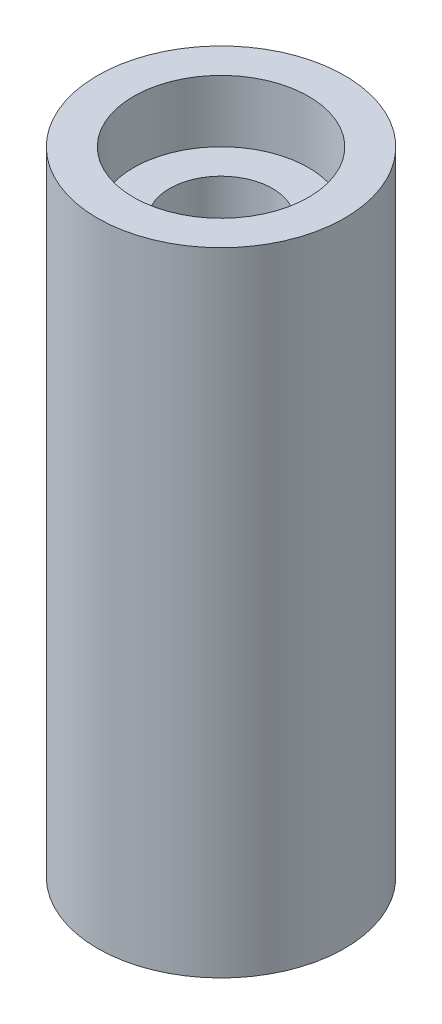
ISO-10303-21;
HEADER;
FILE_DESCRIPTION(('STEP AP214'),'2;1');
FILE_NAME('part.step','',(''),(''),'','','');
FILE_SCHEMA(('AUTOMOTIVE_DESIGN { 1 0 10303 214 1 1 1 1 }'));
ENDSEC;
DATA;
#1=APPLICATION_CONTEXT('core data for automotive mechanical design processes');
#2=APPLICATION_PROTOCOL_DEFINITION('international standard','automotive_design',2000,#1);
#3=PRODUCT_CONTEXT('',#1,'mechanical');
#4=PRODUCT('Part','Part','',(#3));
#5=PRODUCT_RELATED_PRODUCT_CATEGORY('part','',(#4));
#6=PRODUCT_DEFINITION_FORMATION('','',#4);
#7=PRODUCT_DEFINITION_CONTEXT('part definition',#1,'design');
#8=PRODUCT_DEFINITION('design','',#6,#7);
#9=PRODUCT_DEFINITION_SHAPE('','',#8);
#10=(LENGTH_UNIT() NAMED_UNIT(*) SI_UNIT(.MILLI.,.METRE.));
#11=(NAMED_UNIT(*) PLANE_ANGLE_UNIT() SI_UNIT($,.RADIAN.));
#12=(NAMED_UNIT(*) SI_UNIT($,.STERADIAN.) SOLID_ANGLE_UNIT());
#13=UNCERTAINTY_MEASURE_WITH_UNIT(LENGTH_MEASURE(1.E-05),#10,'distance_accuracy_value','');
#14=(GEOMETRIC_REPRESENTATION_CONTEXT(3) GLOBAL_UNCERTAINTY_ASSIGNED_CONTEXT((#13)) GLOBAL_UNIT_ASSIGNED_CONTEXT((#10,
#11,#12)) REPRESENTATION_CONTEXT('',''));
#15=CARTESIAN_POINT('',(0.,0.,0.));
#16=DIRECTION('',(0.,0.,1.));
#17=DIRECTION('',(1.,0.,0.));
#18=AXIS2_PLACEMENT_3D('',#15,#16,#17);
#19=CARTESIAN_POINT('',(0.,-97.5,0.));
#20=DIRECTION('',(0.,1.,0.));
#21=DIRECTION('',(0.,0.,1.));
#22=AXIS2_PLACEMENT_3D('',#19,#20,#21);
#23=CYLINDRICAL_SURFACE('',#22,38.1);
#24=CARTESIAN_POINT('',(0.,-97.5,0.));
#25=DIRECTION('',(0.,1.,0.));
#26=DIRECTION('',(0.,0.,1.));
#27=AXIS2_PLACEMENT_3D('',#24,#25,#26);
#28=CIRCLE('',#27,38.1);
#29=CARTESIAN_POINT('',(0.,-97.5,38.1));
#30=VERTEX_POINT('',#29);
#31=EDGE_CURVE('E10',#30,#30,#28,.T.);
#32=ORIENTED_EDGE('',*,*,#31,.T.);
#33=EDGE_LOOP('',(#32));
#34=FACE_BOUND('',#33,.T.);
#35=CARTESIAN_POINT('',(0.,97.5,0.));
#36=DIRECTION('',(0.,1.,0.));
#37=DIRECTION('',(0.,0.,1.));
#38=AXIS2_PLACEMENT_3D('',#35,#36,#37);
#39=CIRCLE('',#38,38.1);
#40=CARTESIAN_POINT('',(0.,97.5,38.1));
#41=VERTEX_POINT('',#40);
#42=EDGE_CURVE('E48',#41,#41,#39,.T.);
#43=ORIENTED_EDGE('',*,*,#42,.F.);
#44=EDGE_LOOP('',(#43));
#45=FACE_BOUND('',#44,.T.);
#46=ADVANCED_FACE('F40',(#34,#45),#23,.T.);
#47=CARTESIAN_POINT('',(0.,-97.5,0.));
#48=DIRECTION('',(0.,1.,0.));
#49=DIRECTION('',(0.,0.,1.));
#50=AXIS2_PLACEMENT_3D('',#47,#48,#49);
#51=PLANE('',#50);
#52=CARTESIAN_POINT('',(0.,-97.5,0.));
#53=DIRECTION('',(0.,1.,0.));
#54=DIRECTION('',(0.,0.,1.));
#55=AXIS2_PLACEMENT_3D('',#52,#53,#54);
#56=CIRCLE('',#55,26.9875);
#57=CARTESIAN_POINT('',(0.,-97.5,26.9875));
#58=VERTEX_POINT('',#57);
#59=EDGE_CURVE('E64',#58,#58,#56,.T.);
#60=ORIENTED_EDGE('',*,*,#59,.T.);
#61=EDGE_LOOP('',(#60));
#62=FACE_BOUND('',#61,.T.);
#63=ORIENTED_EDGE('',*,*,#31,.F.);
#64=EDGE_LOOP('',(#63));
#65=FACE_BOUND('',#64,.T.);
#66=ADVANCED_FACE('F95',(#62,#65),#51,.F.);
#67=CARTESIAN_POINT('',(0.,97.5,0.));
#68=DIRECTION('',(0.,1.,0.));
#69=DIRECTION('',(0.,0.,1.));
#70=AXIS2_PLACEMENT_3D('',#67,#68,#69);
#71=PLANE('',#70);
#72=CARTESIAN_POINT('',(0.,97.5,0.));
#73=DIRECTION('',(0.,1.,0.));
#74=DIRECTION('',(0.,0.,1.));
#75=AXIS2_PLACEMENT_3D('',#72,#73,#74);
#76=CIRCLE('',#75,26.9875);
#77=CARTESIAN_POINT('',(0.,97.5,26.9875));
#78=VERTEX_POINT('',#77);
#79=EDGE_CURVE('E56',#78,#78,#76,.T.);
#80=ORIENTED_EDGE('',*,*,#79,.F.);
#81=EDGE_LOOP('',(#80));
#82=FACE_BOUND('',#81,.T.);
#83=ORIENTED_EDGE('',*,*,#42,.T.);
#84=EDGE_LOOP('',(#83));
#85=FACE_BOUND('',#84,.T.);
#86=ADVANCED_FACE('F98',(#82,#85),#71,.T.);
#87=CARTESIAN_POINT('',(0.,78.45,0.));
#88=DIRECTION('',(0.,1.,0.));
#89=DIRECTION('',(0.,0.,1.));
#90=AXIS2_PLACEMENT_3D('',#87,#88,#89);
#91=CYLINDRICAL_SURFACE('',#90,26.9875);
#92=CARTESIAN_POINT('',(0.,78.45,0.));
#93=DIRECTION('',(0.,1.,0.));
#94=DIRECTION('',(0.,0.,1.));
#95=AXIS2_PLACEMENT_3D('',#92,#93,#94);
#96=CIRCLE('',#95,26.9875);
#97=CARTESIAN_POINT('',(0.,78.45,26.9875));
#98=VERTEX_POINT('',#97);
#99=EDGE_CURVE('E53',#98,#98,#96,.T.);
#100=ORIENTED_EDGE('',*,*,#99,.F.);
#101=EDGE_LOOP('',(#100));
#102=FACE_BOUND('',#101,.T.);
#103=ORIENTED_EDGE('',*,*,#79,.T.);
#104=EDGE_LOOP('',(#103));
#105=FACE_BOUND('',#104,.T.);
#106=ADVANCED_FACE('F103',(#102,#105),#91,.F.);
#107=CARTESIAN_POINT('',(0.,78.45,0.));
#108=DIRECTION('',(0.,1.,0.));
#109=DIRECTION('',(0.,0.,1.));
#110=AXIS2_PLACEMENT_3D('',#107,#108,#109);
#111=PLANE('',#110);
#112=CARTESIAN_POINT('',(0.,78.45,0.));
#113=DIRECTION('',(0.,1.,0.));
#114=DIRECTION('',(0.,0.,1.));
#115=AXIS2_PLACEMENT_3D('',#112,#113,#114);
#116=CIRCLE('',#115,15.875);
#117=CARTESIAN_POINT('',(0.,78.45,15.875));
#118=VERTEX_POINT('',#117);
#119=EDGE_CURVE('E71',#118,#118,#116,.T.);
#120=ORIENTED_EDGE('',*,*,#119,.F.);
#121=EDGE_LOOP('',(#120));
#122=FACE_BOUND('',#121,.T.);
#123=ORIENTED_EDGE('',*,*,#99,.T.);
#124=EDGE_LOOP('',(#123));
#125=FACE_BOUND('',#124,.T.);
#126=ADVANCED_FACE('F91',(#122,#125),#111,.T.);
#127=CARTESIAN_POINT('',(0.,-78.45,0.));
#128=DIRECTION('',(0.,-1.,0.));
#129=DIRECTION('',(0.,0.,-1.));
#130=AXIS2_PLACEMENT_3D('',#127,#128,#129);
#131=CYLINDRICAL_SURFACE('',#130,26.9875);
#132=CARTESIAN_POINT('',(0.,-78.45,0.));
#133=DIRECTION('',(0.,1.,0.));
#134=DIRECTION('',(0.,0.,1.));
#135=AXIS2_PLACEMENT_3D('',#132,#133,#134);
#136=CIRCLE('',#135,26.9875);
#137=CARTESIAN_POINT('',(0.,-78.45,26.9875));
#138=VERTEX_POINT('',#137);
#139=EDGE_CURVE('E60',#138,#138,#136,.T.);
#140=ORIENTED_EDGE('',*,*,#139,.T.);
#141=EDGE_LOOP('',(#140));
#142=FACE_BOUND('',#141,.T.);
#143=ORIENTED_EDGE('',*,*,#59,.F.);
#144=EDGE_LOOP('',(#143));
#145=FACE_BOUND('',#144,.T.);
#146=ADVANCED_FACE('F85',(#142,#145),#131,.F.);
#147=CARTESIAN_POINT('',(0.,-78.45,0.));
#148=DIRECTION('',(0.,-1.,0.));
#149=DIRECTION('',(0.,0.,1.));
#150=AXIS2_PLACEMENT_3D('',#147,#148,#149);
#151=PLANE('',#150);
#152=CARTESIAN_POINT('',(0.,-78.45,0.));
#153=DIRECTION('',(0.,-1.,0.));
#154=DIRECTION('',(0.,0.,-1.));
#155=AXIS2_PLACEMENT_3D('',#152,#153,#154);
#156=CIRCLE('',#155,15.875);
#157=CARTESIAN_POINT('',(0.,-78.45,-15.875));
#158=VERTEX_POINT('',#157);
#159=EDGE_CURVE('E43',#158,#158,#156,.T.);
#160=ORIENTED_EDGE('',*,*,#159,.F.);
#161=EDGE_LOOP('',(#160));
#162=FACE_BOUND('',#161,.T.);
#163=ORIENTED_EDGE('',*,*,#139,.F.);
#164=EDGE_LOOP('',(#163));
#165=FACE_BOUND('',#164,.T.);
#166=ADVANCED_FACE('F82',(#162,#165),#151,.T.);
#167=CARTESIAN_POINT('',(0.,-97.5,0.));
#168=DIRECTION('',(0.,1.,0.));
#169=DIRECTION('',(0.,0.,1.));
#170=AXIS2_PLACEMENT_3D('',#167,#168,#169);
#171=CYLINDRICAL_SURFACE('',#170,15.875);
#172=ORIENTED_EDGE('',*,*,#159,.T.);
#173=EDGE_LOOP('',(#172));
#174=FACE_BOUND('',#173,.T.);
#175=ORIENTED_EDGE('',*,*,#119,.T.);
#176=EDGE_LOOP('',(#175));
#177=FACE_BOUND('',#176,.T.);
#178=ADVANCED_FACE('F80',(#174,#177),#171,.F.);
#179=CLOSED_SHELL('',(#46,#66,#86,#106,#126,#146,#166,#178));
#180=MANIFOLD_SOLID_BREP('B2',#179);
#181=ADVANCED_BREP_SHAPE_REPRESENTATION('',(#18,#180),#14);
#182=SHAPE_DEFINITION_REPRESENTATION(#9,#181);
ENDSEC;
END-ISO-10303-21;
